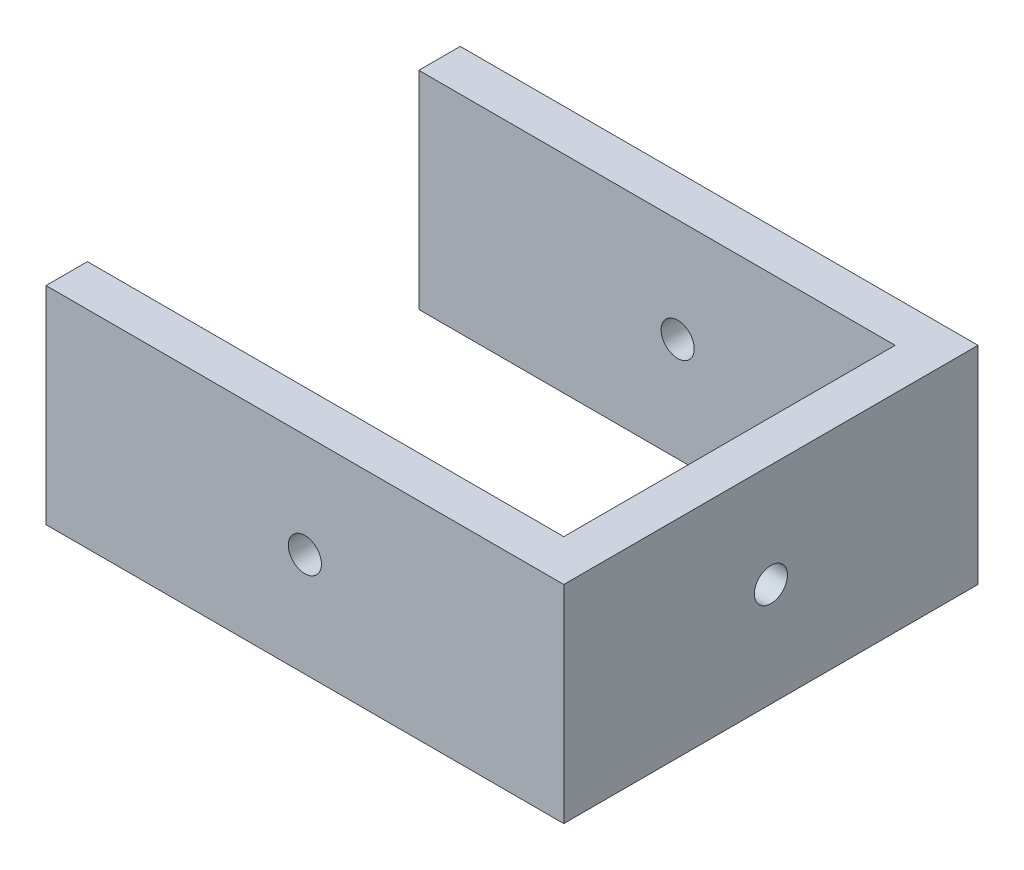
ISO-10303-21;
HEADER;
FILE_DESCRIPTION(('STEP AP214'),'2;1');
FILE_NAME('part.step','',(''),(''),'','','');
FILE_SCHEMA(('AUTOMOTIVE_DESIGN { 1 0 10303 214 1 1 1 1 }'));
ENDSEC;
DATA;
#1=APPLICATION_CONTEXT('core data for automotive mechanical design processes');
#2=APPLICATION_PROTOCOL_DEFINITION('international standard','automotive_design',2000,#1);
#3=PRODUCT_CONTEXT('',#1,'mechanical');
#4=PRODUCT('Part','Part','',(#3));
#5=PRODUCT_RELATED_PRODUCT_CATEGORY('part','',(#4));
#6=PRODUCT_DEFINITION_FORMATION('','',#4);
#7=PRODUCT_DEFINITION_CONTEXT('part definition',#1,'design');
#8=PRODUCT_DEFINITION('design','',#6,#7);
#9=PRODUCT_DEFINITION_SHAPE('','',#8);
#10=(LENGTH_UNIT() NAMED_UNIT(*) SI_UNIT(.MILLI.,.METRE.));
#11=(NAMED_UNIT(*) PLANE_ANGLE_UNIT() SI_UNIT($,.RADIAN.));
#12=(NAMED_UNIT(*) SI_UNIT($,.STERADIAN.) SOLID_ANGLE_UNIT());
#13=UNCERTAINTY_MEASURE_WITH_UNIT(LENGTH_MEASURE(1.E-05),#10,'distance_accuracy_value','');
#14=(GEOMETRIC_REPRESENTATION_CONTEXT(3) GLOBAL_UNCERTAINTY_ASSIGNED_CONTEXT((#13)) GLOBAL_UNIT_ASSIGNED_CONTEXT((#10,
#11,#12)) REPRESENTATION_CONTEXT('',''));
#15=CARTESIAN_POINT('',(0.,0.,0.));
#16=DIRECTION('',(0.,0.,1.));
#17=DIRECTION('',(1.,0.,0.));
#18=AXIS2_PLACEMENT_3D('',#15,#16,#17);
#19=CARTESIAN_POINT('',(-10.,0.,0.));
#20=DIRECTION('',(1.,0.,0.));
#21=DIRECTION('',(0.,0.,-1.));
#22=AXIS2_PLACEMENT_3D('',#19,#20,#21);
#23=PLANE('',#22);
#24=CARTESIAN_POINT('',(-10.,0.,0.));
#25=DIRECTION('',(1.,0.,0.));
#26=DIRECTION('',(0.,0.,-1.));
#27=AXIS2_PLACEMENT_3D('',#24,#25,#26);
#28=CIRCLE('',#27,4.);
#29=CARTESIAN_POINT('',(-10.,0.,-4.));
#30=VERTEX_POINT('',#29);
#31=EDGE_CURVE('E159',#30,#30,#28,.T.);
#32=ORIENTED_EDGE('',*,*,#31,.T.);
#33=EDGE_LOOP('',(#32));
#34=FACE_BOUND('',#33,.T.);
#35=DIRECTION('',(0.,0.,-1.));
#36=VECTOR('',#35,1.);
#37=CARTESIAN_POINT('',(-10.,-25.,50.));
#38=LINE('',#37,#36);
#39=CARTESIAN_POINT('',(-10.,-25.,40.));
#40=VERTEX_POINT('',#39);
#41=CARTESIAN_POINT('',(-10.,-25.,-40.));
#42=VERTEX_POINT('',#41);
#43=EDGE_CURVE('E165',#40,#42,#38,.T.);
#44=ORIENTED_EDGE('',*,*,#43,.F.);
#45=DIRECTION('',(0.,1.,0.));
#46=VECTOR('',#45,1.);
#47=CARTESIAN_POINT('',(-10.,0.,40.));
#48=LINE('',#47,#46);
#49=CARTESIAN_POINT('',(-10.,25.,40.));
#50=VERTEX_POINT('',#49);
#51=EDGE_CURVE('E132',#40,#50,#48,.T.);
#52=ORIENTED_EDGE('',*,*,#51,.T.);
#53=DIRECTION('',(0.,0.,1.));
#54=VECTOR('',#53,1.);
#55=CARTESIAN_POINT('',(-10.,25.,50.));
#56=LINE('',#55,#54);
#57=CARTESIAN_POINT('',(-10.,25.,-40.));
#58=VERTEX_POINT('',#57);
#59=EDGE_CURVE('E108',#58,#50,#56,.T.);
#60=ORIENTED_EDGE('',*,*,#59,.F.);
#61=DIRECTION('',(0.,1.,0.));
#62=VECTOR('',#61,1.);
#63=CARTESIAN_POINT('',(-10.,0.,-40.));
#64=LINE('',#63,#62);
#65=EDGE_CURVE('E154',#42,#58,#64,.T.);
#66=ORIENTED_EDGE('',*,*,#65,.F.);
#67=EDGE_LOOP('',(#44,#52,#60,#66));
#68=FACE_BOUND('',#67,.T.);
#69=ADVANCED_FACE('F34',(#34,#68),#23,.F.);
#70=CARTESIAN_POINT('',(-10.,25.,50.));
#71=DIRECTION('',(0.,0.,1.));
#72=DIRECTION('',(0.,-1.,0.));
#73=AXIS2_PLACEMENT_3D('',#70,#71,#72);
#74=PLANE('',#73);
#75=DIRECTION('',(0.,-1.,0.));
#76=VECTOR('',#75,1.);
#77=CARTESIAN_POINT('',(0.,25.,50.));
#78=LINE('',#77,#76);
#79=CARTESIAN_POINT('',(0.,25.,50.));
#80=VERTEX_POINT('',#79);
#81=CARTESIAN_POINT('',(0.,-25.,50.));
#82=VERTEX_POINT('',#81);
#83=EDGE_CURVE('E162',#80,#82,#78,.T.);
#84=ORIENTED_EDGE('',*,*,#83,.F.);
#85=DIRECTION('',(1.,0.,0.));
#86=VECTOR('',#85,1.);
#87=CARTESIAN_POINT('',(-10.,25.,50.));
#88=LINE('',#87,#86);
#89=CARTESIAN_POINT('',(-125.,25.,50.));
#90=VERTEX_POINT('',#89);
#91=EDGE_CURVE('E11',#90,#80,#88,.T.);
#92=ORIENTED_EDGE('',*,*,#91,.F.);
#93=DIRECTION('',(0.,-1.,0.));
#94=VECTOR('',#93,1.);
#95=CARTESIAN_POINT('',(-125.,25.,50.));
#96=LINE('',#95,#94);
#97=CARTESIAN_POINT('',(-125.,-25.,50.));
#98=VERTEX_POINT('',#97);
#99=EDGE_CURVE('E113',#90,#98,#96,.T.);
#100=ORIENTED_EDGE('',*,*,#99,.T.);
#101=DIRECTION('',(1.,0.,0.));
#102=VECTOR('',#101,1.);
#103=CARTESIAN_POINT('',(-10.,-25.,50.));
#104=LINE('',#103,#102);
#105=EDGE_CURVE('E38',#98,#82,#104,.T.);
#106=ORIENTED_EDGE('',*,*,#105,.T.);
#107=EDGE_LOOP('',(#84,#92,#100,#106));
#108=FACE_BOUND('',#107,.T.);
#109=CARTESIAN_POINT('',(-62.5,0.,50.));
#110=DIRECTION('',(0.,0.,1.));
#111=DIRECTION('',(1.,0.,0.));
#112=AXIS2_PLACEMENT_3D('',#109,#110,#111);
#113=CIRCLE('',#112,4.00000000000001);
#114=CARTESIAN_POINT('',(-58.5,0.,50.));
#115=VERTEX_POINT('',#114);
#116=EDGE_CURVE('E338',#115,#115,#113,.T.);
#117=ORIENTED_EDGE('',*,*,#116,.F.);
#118=EDGE_LOOP('',(#117));
#119=FACE_BOUND('',#118,.T.);
#120=ADVANCED_FACE('F36',(#108,#119),#74,.T.);
#121=CARTESIAN_POINT('',(-10.,25.,50.));
#122=DIRECTION('',(0.,1.,0.));
#123=DIRECTION('',(0.,0.,1.));
#124=AXIS2_PLACEMENT_3D('',#121,#122,#123);
#125=PLANE('',#124);
#126=ORIENTED_EDGE('',*,*,#59,.T.);
#127=DIRECTION('',(-1.,0.,0.));
#128=VECTOR('',#127,1.);
#129=CARTESIAN_POINT('',(0.,25.,40.));
#130=LINE('',#129,#128);
#131=CARTESIAN_POINT('',(-125.,25.,40.));
#132=VERTEX_POINT('',#131);
#133=EDGE_CURVE('E101',#50,#132,#130,.T.);
#134=ORIENTED_EDGE('',*,*,#133,.T.);
#135=DIRECTION('',(0.,0.,1.));
#136=VECTOR('',#135,1.);
#137=CARTESIAN_POINT('',(-125.,25.,40.));
#138=LINE('',#137,#136);
#139=EDGE_CURVE('E104',#132,#90,#138,.T.);
#140=ORIENTED_EDGE('',*,*,#139,.T.);
#141=ORIENTED_EDGE('',*,*,#91,.T.);
#142=DIRECTION('',(0.,0.,1.));
#143=VECTOR('',#142,1.);
#144=CARTESIAN_POINT('',(0.,25.,50.));
#145=LINE('',#144,#143);
#146=CARTESIAN_POINT('',(0.,25.,-50.));
#147=VERTEX_POINT('',#146);
#148=EDGE_CURVE('E51',#147,#80,#145,.T.);
#149=ORIENTED_EDGE('',*,*,#148,.F.);
#150=DIRECTION('',(1.,0.,0.));
#151=VECTOR('',#150,1.);
#152=CARTESIAN_POINT('',(-10.,25.,-50.));
#153=LINE('',#152,#151);
#154=CARTESIAN_POINT('',(-125.,25.,-50.));
#155=VERTEX_POINT('',#154);
#156=EDGE_CURVE('E43',#155,#147,#153,.T.);
#157=ORIENTED_EDGE('',*,*,#156,.F.);
#158=DIRECTION('',(0.,0.,-1.));
#159=VECTOR('',#158,1.);
#160=CARTESIAN_POINT('',(-125.,25.,-40.));
#161=LINE('',#160,#159);
#162=CARTESIAN_POINT('',(-125.,25.,-40.));
#163=VERTEX_POINT('',#162);
#164=EDGE_CURVE('E151',#163,#155,#161,.T.);
#165=ORIENTED_EDGE('',*,*,#164,.F.);
#166=DIRECTION('',(1.,0.,0.));
#167=VECTOR('',#166,1.);
#168=CARTESIAN_POINT('',(0.,25.,-40.));
#169=LINE('',#168,#167);
#170=EDGE_CURVE('E147',#163,#58,#169,.T.);
#171=ORIENTED_EDGE('',*,*,#170,.T.);
#172=EDGE_LOOP('',(#126,#134,#140,#141,#149,#157,#165,#171));
#173=FACE_BOUND('',#172,.T.);
#174=ADVANCED_FACE('F103',(#173),#125,.T.);
#175=CARTESIAN_POINT('',(-10.,25.,-50.));
#176=DIRECTION('',(0.,0.,-1.));
#177=DIRECTION('',(0.,1.,0.));
#178=AXIS2_PLACEMENT_3D('',#175,#176,#177);
#179=PLANE('',#178);
#180=DIRECTION('',(0.,1.,0.));
#181=VECTOR('',#180,1.);
#182=CARTESIAN_POINT('',(0.,25.,-50.));
#183=LINE('',#182,#181);
#184=CARTESIAN_POINT('',(0.,-25.,-50.));
#185=VERTEX_POINT('',#184);
#186=EDGE_CURVE('E171',#185,#147,#183,.T.);
#187=ORIENTED_EDGE('',*,*,#186,.F.);
#188=DIRECTION('',(1.,0.,0.));
#189=VECTOR('',#188,1.);
#190=CARTESIAN_POINT('',(-10.,-25.,-50.));
#191=LINE('',#190,#189);
#192=CARTESIAN_POINT('',(-125.,-25.,-50.));
#193=VERTEX_POINT('',#192);
#194=EDGE_CURVE('E174',#193,#185,#191,.T.);
#195=ORIENTED_EDGE('',*,*,#194,.F.);
#196=DIRECTION('',(0.,1.,0.));
#197=VECTOR('',#196,1.);
#198=CARTESIAN_POINT('',(-125.,25.,-50.));
#199=LINE('',#198,#197);
#200=EDGE_CURVE('E139',#193,#155,#199,.T.);
#201=ORIENTED_EDGE('',*,*,#200,.T.);
#202=ORIENTED_EDGE('',*,*,#156,.T.);
#203=EDGE_LOOP('',(#187,#195,#201,#202));
#204=FACE_BOUND('',#203,.T.);
#205=CARTESIAN_POINT('',(-62.5,0.,-50.));
#206=DIRECTION('',(0.,0.,-1.));
#207=DIRECTION('',(-1.,0.,0.));
#208=AXIS2_PLACEMENT_3D('',#205,#206,#207);
#209=CIRCLE('',#208,4.00000000000001);
#210=CARTESIAN_POINT('',(-66.5,0.,-50.));
#211=VERTEX_POINT('',#210);
#212=EDGE_CURVE('E135',#211,#211,#209,.T.);
#213=ORIENTED_EDGE('',*,*,#212,.F.);
#214=EDGE_LOOP('',(#213));
#215=FACE_BOUND('',#214,.T.);
#216=ADVANCED_FACE('F211',(#204,#215),#179,.T.);
#217=CARTESIAN_POINT('',(-10.,-25.,50.));
#218=DIRECTION('',(0.,-1.,0.));
#219=DIRECTION('',(0.,0.,-1.));
#220=AXIS2_PLACEMENT_3D('',#217,#218,#219);
#221=PLANE('',#220);
#222=ORIENTED_EDGE('',*,*,#194,.T.);
#223=DIRECTION('',(0.,0.,-1.));
#224=VECTOR('',#223,1.);
#225=CARTESIAN_POINT('',(0.,-25.,50.));
#226=LINE('',#225,#224);
#227=EDGE_CURVE('E169',#82,#185,#226,.T.);
#228=ORIENTED_EDGE('',*,*,#227,.F.);
#229=ORIENTED_EDGE('',*,*,#105,.F.);
#230=DIRECTION('',(0.,0.,1.));
#231=VECTOR('',#230,1.);
#232=CARTESIAN_POINT('',(-125.,-25.,40.));
#233=LINE('',#232,#231);
#234=CARTESIAN_POINT('',(-125.,-25.,40.));
#235=VERTEX_POINT('',#234);
#236=EDGE_CURVE('E121',#235,#98,#233,.T.);
#237=ORIENTED_EDGE('',*,*,#236,.F.);
#238=DIRECTION('',(1.,0.,0.));
#239=VECTOR('',#238,1.);
#240=CARTESIAN_POINT('',(0.,-25.,40.));
#241=LINE('',#240,#239);
#242=EDGE_CURVE('E122',#235,#40,#241,.T.);
#243=ORIENTED_EDGE('',*,*,#242,.T.);
#244=ORIENTED_EDGE('',*,*,#43,.T.);
#245=DIRECTION('',(-1.,0.,0.));
#246=VECTOR('',#245,1.);
#247=CARTESIAN_POINT('',(0.,-25.,-40.));
#248=LINE('',#247,#246);
#249=CARTESIAN_POINT('',(-125.,-25.,-40.));
#250=VERTEX_POINT('',#249);
#251=EDGE_CURVE('E142',#42,#250,#248,.T.);
#252=ORIENTED_EDGE('',*,*,#251,.T.);
#253=DIRECTION('',(0.,0.,-1.));
#254=VECTOR('',#253,1.);
#255=CARTESIAN_POINT('',(-125.,-25.,-40.));
#256=LINE('',#255,#254);
#257=EDGE_CURVE('E149',#250,#193,#256,.T.);
#258=ORIENTED_EDGE('',*,*,#257,.T.);
#259=EDGE_LOOP('',(#222,#228,#229,#237,#243,#244,#252,#258));
#260=FACE_BOUND('',#259,.T.);
#261=ADVANCED_FACE('F181',(#260),#221,.T.);
#262=CARTESIAN_POINT('',(0.,0.,0.));
#263=DIRECTION('',(1.,0.,0.));
#264=DIRECTION('',(0.,0.,-1.));
#265=AXIS2_PLACEMENT_3D('',#262,#263,#264);
#266=PLANE('',#265);
#267=ORIENTED_EDGE('',*,*,#148,.T.);
#268=ORIENTED_EDGE('',*,*,#83,.T.);
#269=ORIENTED_EDGE('',*,*,#227,.T.);
#270=ORIENTED_EDGE('',*,*,#186,.T.);
#271=EDGE_LOOP('',(#267,#268,#269,#270));
#272=FACE_BOUND('',#271,.T.);
#273=CARTESIAN_POINT('',(0.,0.,0.));
#274=DIRECTION('',(1.,0.,0.));
#275=DIRECTION('',(0.,0.,-1.));
#276=AXIS2_PLACEMENT_3D('',#273,#274,#275);
#277=CIRCLE('',#276,4.);
#278=CARTESIAN_POINT('',(0.,0.,-4.));
#279=VERTEX_POINT('',#278);
#280=EDGE_CURVE('E158',#279,#279,#277,.T.);
#281=ORIENTED_EDGE('',*,*,#280,.F.);
#282=EDGE_LOOP('',(#281));
#283=FACE_BOUND('',#282,.T.);
#284=ADVANCED_FACE('F182',(#272,#283),#266,.T.);
#285=CARTESIAN_POINT('',(-10.,0.,0.));
#286=DIRECTION('',(1.,0.,0.));
#287=DIRECTION('',(0.,0.,-1.));
#288=AXIS2_PLACEMENT_3D('',#285,#286,#287);
#289=CYLINDRICAL_SURFACE('',#288,4.);
#290=ORIENTED_EDGE('',*,*,#31,.F.);
#291=EDGE_LOOP('',(#290));
#292=FACE_BOUND('',#291,.T.);
#293=ORIENTED_EDGE('',*,*,#280,.T.);
#294=EDGE_LOOP('',(#293));
#295=FACE_BOUND('',#294,.T.);
#296=ADVANCED_FACE('F185',(#292,#295),#289,.F.);
#297=CARTESIAN_POINT('',(0.,0.,-40.));
#298=DIRECTION('',(0.,0.,-1.));
#299=DIRECTION('',(-1.,0.,0.));
#300=AXIS2_PLACEMENT_3D('',#297,#298,#299);
#301=PLANE('',#300);
#302=CARTESIAN_POINT('',(-62.5,0.,-40.));
#303=DIRECTION('',(0.,0.,-1.));
#304=DIRECTION('',(-1.,0.,0.));
#305=AXIS2_PLACEMENT_3D('',#302,#303,#304);
#306=CIRCLE('',#305,4.00000000000001);
#307=CARTESIAN_POINT('',(-66.5,0.,-40.));
#308=VERTEX_POINT('',#307);
#309=EDGE_CURVE('E136',#308,#308,#306,.T.);
#310=ORIENTED_EDGE('',*,*,#309,.T.);
#311=EDGE_LOOP('',(#310));
#312=FACE_BOUND('',#311,.T.);
#313=ORIENTED_EDGE('',*,*,#251,.F.);
#314=ORIENTED_EDGE('',*,*,#65,.T.);
#315=ORIENTED_EDGE('',*,*,#170,.F.);
#316=DIRECTION('',(0.,1.,0.));
#317=VECTOR('',#316,1.);
#318=CARTESIAN_POINT('',(-125.,25.,-40.));
#319=LINE('',#318,#317);
#320=EDGE_CURVE('E144',#250,#163,#319,.T.);
#321=ORIENTED_EDGE('',*,*,#320,.F.);
#322=EDGE_LOOP('',(#313,#314,#315,#321));
#323=FACE_BOUND('',#322,.T.);
#324=ADVANCED_FACE('F190',(#312,#323),#301,.F.);
#325=CARTESIAN_POINT('',(-125.,25.,-40.));
#326=DIRECTION('',(-1.,0.,0.));
#327=DIRECTION('',(0.,0.,1.));
#328=AXIS2_PLACEMENT_3D('',#325,#326,#327);
#329=PLANE('',#328);
#330=ORIENTED_EDGE('',*,*,#200,.F.);
#331=ORIENTED_EDGE('',*,*,#257,.F.);
#332=ORIENTED_EDGE('',*,*,#320,.T.);
#333=ORIENTED_EDGE('',*,*,#164,.T.);
#334=EDGE_LOOP('',(#330,#331,#332,#333));
#335=FACE_BOUND('',#334,.T.);
#336=ADVANCED_FACE('F196',(#335),#329,.T.);
#337=CARTESIAN_POINT('',(-62.5,0.,-40.));
#338=DIRECTION('',(0.,0.,-1.));
#339=DIRECTION('',(-1.,0.,0.));
#340=AXIS2_PLACEMENT_3D('',#337,#338,#339);
#341=CYLINDRICAL_SURFACE('',#340,4.00000000000001);
#342=ORIENTED_EDGE('',*,*,#309,.F.);
#343=EDGE_LOOP('',(#342));
#344=FACE_BOUND('',#343,.T.);
#345=ORIENTED_EDGE('',*,*,#212,.T.);
#346=EDGE_LOOP('',(#345));
#347=FACE_BOUND('',#346,.T.);
#348=ADVANCED_FACE('F234',(#344,#347),#341,.F.);
#349=CARTESIAN_POINT('',(0.,0.,40.));
#350=DIRECTION('',(0.,0.,-1.));
#351=DIRECTION('',(-1.,0.,0.));
#352=AXIS2_PLACEMENT_3D('',#349,#350,#351);
#353=PLANE('',#352);
#354=CARTESIAN_POINT('',(-62.5,0.,40.));
#355=DIRECTION('',(0.,0.,1.));
#356=DIRECTION('',(1.,0.,0.));
#357=AXIS2_PLACEMENT_3D('',#354,#355,#356);
#358=CIRCLE('',#357,4.00000000000001);
#359=CARTESIAN_POINT('',(-58.5,0.,40.));
#360=VERTEX_POINT('',#359);
#361=EDGE_CURVE('E131',#360,#360,#358,.T.);
#362=ORIENTED_EDGE('',*,*,#361,.T.);
#363=EDGE_LOOP('',(#362));
#364=FACE_BOUND('',#363,.T.);
#365=ORIENTED_EDGE('',*,*,#51,.F.);
#366=ORIENTED_EDGE('',*,*,#242,.F.);
#367=DIRECTION('',(0.,-1.,0.));
#368=VECTOR('',#367,1.);
#369=CARTESIAN_POINT('',(-125.,25.,40.));
#370=LINE('',#369,#368);
#371=EDGE_CURVE('E112',#132,#235,#370,.T.);
#372=ORIENTED_EDGE('',*,*,#371,.F.);
#373=ORIENTED_EDGE('',*,*,#133,.F.);
#374=EDGE_LOOP('',(#365,#366,#372,#373));
#375=FACE_BOUND('',#374,.T.);
#376=ADVANCED_FACE('F124',(#364,#375),#353,.T.);
#377=CARTESIAN_POINT('',(-125.,25.,40.));
#378=DIRECTION('',(-1.,0.,0.));
#379=DIRECTION('',(0.,0.,1.));
#380=AXIS2_PLACEMENT_3D('',#377,#378,#379);
#381=PLANE('',#380);
#382=ORIENTED_EDGE('',*,*,#99,.F.);
#383=ORIENTED_EDGE('',*,*,#139,.F.);
#384=ORIENTED_EDGE('',*,*,#371,.T.);
#385=ORIENTED_EDGE('',*,*,#236,.T.);
#386=EDGE_LOOP('',(#382,#383,#384,#385));
#387=FACE_BOUND('',#386,.T.);
#388=ADVANCED_FACE('F117',(#387),#381,.T.);
#389=CARTESIAN_POINT('',(-62.5,0.,40.));
#390=DIRECTION('',(0.,0.,1.));
#391=DIRECTION('',(1.,0.,0.));
#392=AXIS2_PLACEMENT_3D('',#389,#390,#391);
#393=CYLINDRICAL_SURFACE('',#392,4.00000000000001);
#394=ORIENTED_EDGE('',*,*,#361,.F.);
#395=EDGE_LOOP('',(#394));
#396=FACE_BOUND('',#395,.T.);
#397=ORIENTED_EDGE('',*,*,#116,.T.);
#398=EDGE_LOOP('',(#397));
#399=FACE_BOUND('',#398,.T.);
#400=ADVANCED_FACE('F245',(#396,#399),#393,.F.);
#401=CLOSED_SHELL('',(#69,#120,#174,#216,#261,#284,#296,#324,#336,#348,#376,#388,#400));
#402=MANIFOLD_SOLID_BREP('B2',#401);
#403=ADVANCED_BREP_SHAPE_REPRESENTATION('',(#18,#402),#14);
#404=SHAPE_DEFINITION_REPRESENTATION(#9,#403);
ENDSEC;
END-ISO-10303-21;
